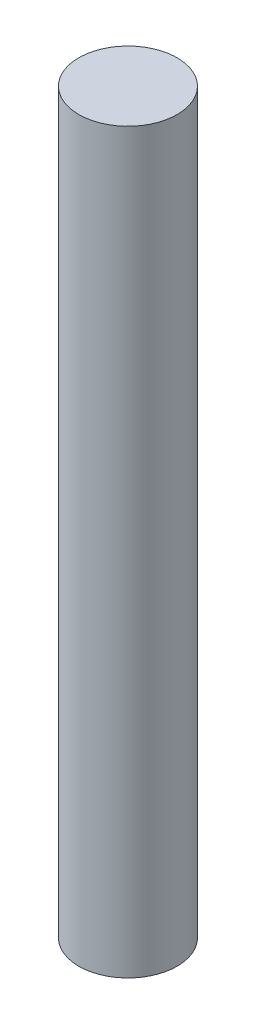
ISO-10303-21;
HEADER;
FILE_DESCRIPTION(('STEP AP214'),'2;1');
FILE_NAME('part.step','',(''),(''),'','','');
FILE_SCHEMA(('AUTOMOTIVE_DESIGN { 1 0 10303 214 1 1 1 1 }'));
ENDSEC;
DATA;
#1=APPLICATION_CONTEXT('core data for automotive mechanical design processes');
#2=APPLICATION_PROTOCOL_DEFINITION('international standard','automotive_design',2000,#1);
#3=PRODUCT_CONTEXT('',#1,'mechanical');
#4=PRODUCT('Part','Part','',(#3));
#5=PRODUCT_RELATED_PRODUCT_CATEGORY('part','',(#4));
#6=PRODUCT_DEFINITION_FORMATION('','',#4);
#7=PRODUCT_DEFINITION_CONTEXT('part definition',#1,'design');
#8=PRODUCT_DEFINITION('design','',#6,#7);
#9=PRODUCT_DEFINITION_SHAPE('','',#8);
#10=(LENGTH_UNIT() NAMED_UNIT(*) SI_UNIT(.MILLI.,.METRE.));
#11=(NAMED_UNIT(*) PLANE_ANGLE_UNIT() SI_UNIT($,.RADIAN.));
#12=(NAMED_UNIT(*) SI_UNIT($,.STERADIAN.) SOLID_ANGLE_UNIT());
#13=UNCERTAINTY_MEASURE_WITH_UNIT(LENGTH_MEASURE(1.E-05),#10,'distance_accuracy_value','');
#14=(GEOMETRIC_REPRESENTATION_CONTEXT(3) GLOBAL_UNCERTAINTY_ASSIGNED_CONTEXT((#13)) GLOBAL_UNIT_ASSIGNED_CONTEXT((#10,
#11,#12)) REPRESENTATION_CONTEXT('',''));
#15=CARTESIAN_POINT('',(0.,0.,0.));
#16=DIRECTION('',(0.,0.,1.));
#17=DIRECTION('',(1.,0.,0.));
#18=AXIS2_PLACEMENT_3D('',#15,#16,#17);
#19=CARTESIAN_POINT('',(0.,15.,0.));
#20=DIRECTION('',(0.,-1.,0.));
#21=DIRECTION('',(0.,0.,-1.));
#22=AXIS2_PLACEMENT_3D('',#19,#20,#21);
#23=CYLINDRICAL_SURFACE('',#22,1.);
#24=CARTESIAN_POINT('',(0.,15.,0.));
#25=DIRECTION('',(0.,1.,0.));
#26=DIRECTION('',(0.,0.,1.));
#27=AXIS2_PLACEMENT_3D('',#24,#25,#26);
#28=CIRCLE('',#27,1.);
#29=CARTESIAN_POINT('',(0.,15.,1.));
#30=VERTEX_POINT('',#29);
#31=EDGE_CURVE('E10',#30,#30,#28,.T.);
#32=ORIENTED_EDGE('',*,*,#31,.F.);
#33=EDGE_LOOP('',(#32));
#34=FACE_BOUND('',#33,.T.);
#35=CARTESIAN_POINT('',(0.,0.,0.));
#36=DIRECTION('',(0.,1.,0.));
#37=DIRECTION('',(0.,0.,1.));
#38=AXIS2_PLACEMENT_3D('',#35,#36,#37);
#39=CIRCLE('',#38,1.);
#40=CARTESIAN_POINT('',(0.,0.,1.));
#41=VERTEX_POINT('',#40);
#42=EDGE_CURVE('E35',#41,#41,#39,.T.);
#43=ORIENTED_EDGE('',*,*,#42,.T.);
#44=EDGE_LOOP('',(#43));
#45=FACE_BOUND('',#44,.T.);
#46=ADVANCED_FACE('F32',(#34,#45),#23,.T.);
#47=CARTESIAN_POINT('',(0.,15.,0.));
#48=DIRECTION('',(0.,1.,0.));
#49=DIRECTION('',(0.,0.,1.));
#50=AXIS2_PLACEMENT_3D('',#47,#48,#49);
#51=PLANE('',#50);
#52=ORIENTED_EDGE('',*,*,#31,.T.);
#53=EDGE_LOOP('',(#52));
#54=FACE_BOUND('',#53,.T.);
#55=ADVANCED_FACE('F47',(#54),#51,.T.);
#56=CARTESIAN_POINT('',(0.,0.,0.));
#57=DIRECTION('',(0.,1.,0.));
#58=DIRECTION('',(0.,0.,1.));
#59=AXIS2_PLACEMENT_3D('',#56,#57,#58);
#60=PLANE('',#59);
#61=ORIENTED_EDGE('',*,*,#42,.F.);
#62=EDGE_LOOP('',(#61));
#63=FACE_BOUND('',#62,.T.);
#64=ADVANCED_FACE('F45',(#63),#60,.F.);
#65=CLOSED_SHELL('',(#46,#55,#64));
#66=MANIFOLD_SOLID_BREP('B2',#65);
#67=ADVANCED_BREP_SHAPE_REPRESENTATION('',(#18,#66),#14);
#68=SHAPE_DEFINITION_REPRESENTATION(#9,#67);
ENDSEC;
END-ISO-10303-21;
